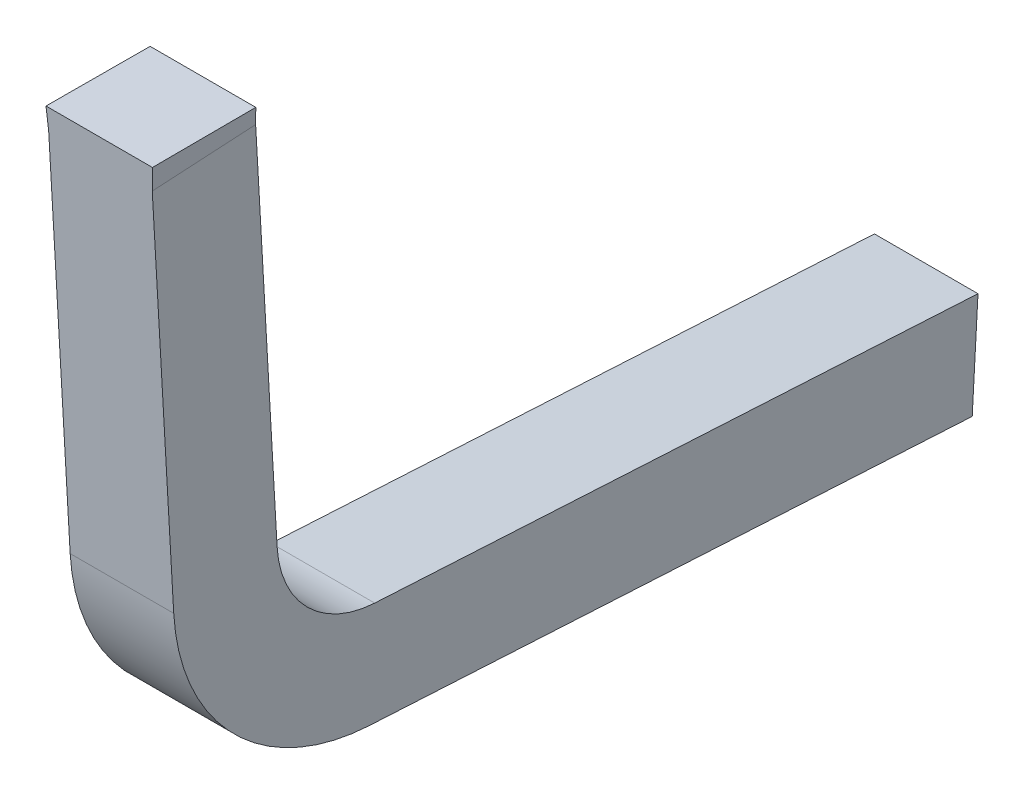
ISO-10303-21;
HEADER;
FILE_DESCRIPTION(('STEP AP214'),'2;1');
FILE_NAME('part.step','',(''),(''),'','','');
FILE_SCHEMA(('AUTOMOTIVE_DESIGN { 1 0 10303 214 1 1 1 1 }'));
ENDSEC;
DATA;
#1=APPLICATION_CONTEXT('core data for automotive mechanical design processes');
#2=APPLICATION_PROTOCOL_DEFINITION('international standard','automotive_design',2000,#1);
#3=PRODUCT_CONTEXT('',#1,'mechanical');
#4=PRODUCT('Part','Part','',(#3));
#5=PRODUCT_RELATED_PRODUCT_CATEGORY('part','',(#4));
#6=PRODUCT_DEFINITION_FORMATION('','',#4);
#7=PRODUCT_DEFINITION_CONTEXT('part definition',#1,'design');
#8=PRODUCT_DEFINITION('design','',#6,#7);
#9=PRODUCT_DEFINITION_SHAPE('','',#8);
#10=(LENGTH_UNIT() NAMED_UNIT(*) SI_UNIT(.MILLI.,.METRE.));
#11=(NAMED_UNIT(*) PLANE_ANGLE_UNIT() SI_UNIT($,.RADIAN.));
#12=(NAMED_UNIT(*) SI_UNIT($,.STERADIAN.) SOLID_ANGLE_UNIT());
#13=UNCERTAINTY_MEASURE_WITH_UNIT(LENGTH_MEASURE(1.E-05),#10,'distance_accuracy_value','');
#14=(GEOMETRIC_REPRESENTATION_CONTEXT(3) GLOBAL_UNCERTAINTY_ASSIGNED_CONTEXT((#13)) GLOBAL_UNIT_ASSIGNED_CONTEXT((#10,
#11,#12)) REPRESENTATION_CONTEXT('',''));
#15=CARTESIAN_POINT('',(0.,0.,0.));
#16=DIRECTION('',(0.,0.,1.));
#17=DIRECTION('',(1.,0.,0.));
#18=AXIS2_PLACEMENT_3D('',#15,#16,#17);
#19=CARTESIAN_POINT('',(4.398593165818,-2.29897527843,-10.34781984343));
#20=DIRECTION('',(0.997785157857701,0.0664110878974701,0.003787632922693));
#21=DIRECTION('',(-0.0664115642747469,0.997792315129046,0.));
#22=AXIS2_PLACEMENT_3D('',#19,#20,#21);
#23=PLANE('',#22);
#24=DIRECTION('',(0.,-0.0569406083110753,0.998377567418842));
#25=VECTOR('',#24,1.);
#26=CARTESIAN_POINT('',(4.4,-2.314349492935,-10.44885919008));
#27=LINE('',#26,#25);
#28=CARTESIAN_POINT('',(4.4,-2.31434949293492,-10.4488591900814));
#29=VERTEX_POINT('',#28);
#30=CARTESIAN_POINT('',(4.4,-2.32573761459728,-10.2491836765951));
#31=VERTEX_POINT('',#30);
#32=EDGE_CURVE('E98',#29,#31,#27,.T.);
#33=ORIENTED_EDGE('',*,*,#32,.T.);
#34=DIRECTION('',(0.0665190105147885,-0.996166318707982,-0.0568144938543089));
#35=VECTOR('',#34,1.);
#36=CARTESIAN_POINT('',(4.397186331635,-2.28360106392498,-10.2467804967704));
#37=LINE('',#36,#35);
#38=CARTESIAN_POINT('',(4.397186331635,-2.28360106392499,-10.2467804967704));
#39=VERTEX_POINT('',#38);
#40=EDGE_CURVE('E148',#39,#31,#37,.T.);
#41=ORIENTED_EDGE('',*,*,#40,.F.);
#42=DIRECTION('',(-0.0037960132015798,0.,0.999992795115932));
#43=VECTOR('',#42,1.);
#44=CARTESIAN_POINT('',(4.397946773511,-2.283601063925,-10.4471055106));
#45=LINE('',#44,#43);
#46=CARTESIAN_POINT('',(4.397946773511,-2.28360106392489,-10.4471055106019));
#47=VERTEX_POINT('',#46);
#48=EDGE_CURVE('E161',#47,#39,#45,.T.);
#49=ORIENTED_EDGE('',*,*,#48,.F.);
#50=DIRECTION('',(0.0665190105273533,-0.996166318707227,-0.0568144938528306));
#51=VECTOR('',#50,1.);
#52=CARTESIAN_POINT('',(4.397946773511,-2.28360106392483,-10.4471055106029));
#53=LINE('',#52,#51);
#54=EDGE_CURVE('E103',#47,#29,#53,.T.);
#55=ORIENTED_EDGE('',*,*,#54,.T.);
#56=EDGE_LOOP('',(#33,#41,#49,#55));
#57=FACE_BOUND('',#56,.T.);
#58=ADVANCED_FACE('F17',(#57),#23,.F.);
#59=CARTESIAN_POINT('',(4.5,-2.283601063925,-10.34694300368));
#60=DIRECTION('',(0.,1.,0.));
#61=DIRECTION('',(0.,0.,1.));
#62=AXIS2_PLACEMENT_3D('',#59,#60,#61);
#63=PLANE('',#62);
#64=DIRECTION('',(1.,0.,0.));
#65=VECTOR('',#64,1.);
#66=CARTESIAN_POINT('',(4.5,-2.28360106392498,-10.2467804967704));
#67=LINE('',#66,#65);
#68=CARTESIAN_POINT('',(4.60281366836525,-2.283601063925,-10.2467804967704));
#69=VERTEX_POINT('',#68);
#70=EDGE_CURVE('E154',#69,#39,#67,.F.);
#71=ORIENTED_EDGE('',*,*,#70,.F.);
#72=DIRECTION('',(0.00379601320426427,-1.7968426456006E-13,0.999992795115921));
#73=VECTOR('',#72,1.);
#74=CARTESIAN_POINT('',(4.6020532264892,-2.28360106392501,-10.4471055106));
#75=LINE('',#74,#73);
#76=CARTESIAN_POINT('',(4.60205322648913,-2.28360106392495,-10.447105510601));
#77=VERTEX_POINT('',#76);
#78=EDGE_CURVE('E119',#77,#69,#75,.T.);
#79=ORIENTED_EDGE('',*,*,#78,.F.);
#80=DIRECTION('',(1.,0.,0.));
#81=VECTOR('',#80,1.);
#82=CARTESIAN_POINT('',(4.5,-2.28360106392483,-10.4471055106029));
#83=LINE('',#82,#81);
#84=EDGE_CURVE('E125',#77,#47,#83,.F.);
#85=ORIENTED_EDGE('',*,*,#84,.T.);
#86=ORIENTED_EDGE('',*,*,#48,.T.);
#87=EDGE_LOOP('',(#71,#79,#85,#86));
#88=FACE_BOUND('',#87,.T.);
#89=ADVANCED_FACE('F243',(#88),#63,.T.);
#90=CARTESIAN_POINT('',(4.4,-2.909472777839,-11.05227927458));
#91=DIRECTION('',(1.,0.,0.));
#92=DIRECTION('',(0.,0.,-1.));
#93=AXIS2_PLACEMENT_3D('',#90,#91,#92);
#94=PLANE('',#93);
#95=CARTESIAN_POINT('',(4.4,-3.03,-10.69));
#96=DIRECTION('',(-1.,0.,0.));
#97=DIRECTION('',(0.,0.,1.));
#98=AXIS2_PLACEMENT_3D('',#95,#96,#97);
#99=CIRCLE('',#98,0.4);
#100=CARTESIAN_POINT('',(4.4,-3.05277624331319,-10.2906489730306));
#101=VERTEX_POINT('',#100);
#102=CARTESIAN_POINT('',(4.4,-3.42937693582933,-10.6676826720305));
#103=VERTEX_POINT('',#102);
#104=EDGE_CURVE('E142',#101,#103,#99,.F.);
#105=ORIENTED_EDGE('',*,*,#104,.F.);
#106=DIRECTION('',(0.,-0.998377567418718,-0.056940608313261));
#107=VECTOR('',#106,1.);
#108=CARTESIAN_POINT('',(4.4,-2.668188653621,-10.2687147349));
#109=LINE('',#108,#107);
#110=EDGE_CURVE('E145',#31,#101,#109,.T.);
#111=ORIENTED_EDGE('',*,*,#110,.F.);
#112=ORIENTED_EDGE('',*,*,#32,.F.);
#113=DIRECTION('',(0.,-0.998377567418801,-0.0569406083117901));
#114=VECTOR('',#113,1.);
#115=CARTESIAN_POINT('',(4.4,-2.662494592804,-10.46871499856));
#116=LINE('',#115,#114);
#117=CARTESIAN_POINT('',(4.4,-3.04138812167726,-10.4903244865168));
#118=VERTEX_POINT('',#117);
#119=EDGE_CURVE('E92',#29,#118,#116,.T.);
#120=ORIENTED_EDGE('',*,*,#119,.T.);
#121=CARTESIAN_POINT('',(4.4,-3.03,-10.69));
#122=DIRECTION('',(-1.,0.,0.));
#123=DIRECTION('',(0.,0.,1.));
#124=AXIS2_PLACEMENT_3D('',#121,#122,#123);
#125=CIRCLE('',#124,0.2);
#126=CARTESIAN_POINT('',(4.4,-3.22968846791482,-10.6788413360177));
#127=VERTEX_POINT('',#126);
#128=EDGE_CURVE('E20',#118,#127,#125,.F.);
#129=ORIENTED_EDGE('',*,*,#128,.T.);
#130=DIRECTION('',(0.,0.0557933199228295,0.998442339572991));
#131=VECTOR('',#130,1.);
#132=CARTESIAN_POINT('',(4.4,-3.262244863925,-11.26145022621));
#133=LINE('',#132,#131);
#134=CARTESIAN_POINT('',(4.4,-3.29480125993501,-11.8440591164004));
#135=VERTEX_POINT('',#134);
#136=EDGE_CURVE('E111',#135,#127,#133,.T.);
#137=ORIENTED_EDGE('',*,*,#136,.F.);
#138=DIRECTION('',(0.,-0.998442339574031,0.0557933199042218));
#139=VECTOR('',#138,1.);
#140=CARTESIAN_POINT('',(4.4,-3.394645493892,-11.83847978441));
#141=LINE('',#140,#139);
#142=CARTESIAN_POINT('',(4.4,-3.49448972784906,-11.8329004524196));
#143=VERTEX_POINT('',#142);
#144=EDGE_CURVE('E135',#135,#143,#141,.T.);
#145=ORIENTED_EDGE('',*,*,#144,.T.);
#146=DIRECTION('',(0.,0.055793319922371,0.998442339573017));
#147=VECTOR('',#146,1.);
#148=CARTESIAN_POINT('',(4.4,-3.461933331839,-11.25029156222));
#149=LINE('',#148,#147);
#150=EDGE_CURVE('E140',#143,#103,#149,.T.);
#151=ORIENTED_EDGE('',*,*,#150,.T.);
#152=EDGE_LOOP('',(#105,#111,#112,#120,#129,#137,#145,#151));
#153=FACE_BOUND('',#152,.T.);
#154=ADVANCED_FACE('F95',(#153),#94,.F.);
#155=CARTESIAN_POINT('',(4.5,-3.262244863925,-11.26145022621));
#156=DIRECTION('',(0.,0.998442339572991,-0.0557933199228295));
#157=DIRECTION('',(0.,0.0557933199228295,0.998442339572991));
#158=AXIS2_PLACEMENT_3D('',#155,#156,#157);
#159=PLANE('',#158);
#160=DIRECTION('',(0.,0.055793319922887,0.998442339572988));
#161=VECTOR('',#160,1.);
#162=CARTESIAN_POINT('',(4.6,-3.294801259935,-11.8440591164));
#163=LINE('',#162,#161);
#164=CARTESIAN_POINT('',(4.6,-3.29480125993501,-11.8440591164001));
#165=VERTEX_POINT('',#164);
#166=CARTESIAN_POINT('',(4.6,-3.2296884679148,-10.6788413360177));
#167=VERTEX_POINT('',#166);
#168=EDGE_CURVE('E129',#165,#167,#163,.T.);
#169=ORIENTED_EDGE('',*,*,#168,.F.);
#170=DIRECTION('',(1.,0.,0.));
#171=VECTOR('',#170,1.);
#172=CARTESIAN_POINT('',(4.5,-3.29480125993502,-11.8440591164004));
#173=LINE('',#172,#171);
#174=EDGE_CURVE('E126',#165,#135,#173,.F.);
#175=ORIENTED_EDGE('',*,*,#174,.T.);
#176=ORIENTED_EDGE('',*,*,#136,.T.);
#177=DIRECTION('',(-1.,0.,0.));
#178=VECTOR('',#177,1.);
#179=CARTESIAN_POINT('',(4.604,-3.22968846791485,-10.67884133602));
#180=LINE('',#179,#178);
#181=EDGE_CURVE('E110',#127,#167,#180,.F.);
#182=ORIENTED_EDGE('',*,*,#181,.T.);
#183=EDGE_LOOP('',(#169,#175,#176,#182));
#184=FACE_BOUND('',#183,.T.);
#185=ADVANCED_FACE('F234',(#184),#159,.T.);
#186=CARTESIAN_POINT('',(4.604,-3.03,-10.69));
#187=DIRECTION('',(-1.,0.,0.));
#188=DIRECTION('',(0.,0.,1.));
#189=AXIS2_PLACEMENT_3D('',#186,#187,#188);
#190=CYLINDRICAL_SURFACE('',#189,0.2);
#191=ORIENTED_EDGE('',*,*,#128,.F.);
#192=DIRECTION('',(1.,0.,0.));
#193=VECTOR('',#192,1.);
#194=CARTESIAN_POINT('',(4.5,-3.04138812169214,-10.4903244865176));
#195=LINE('',#194,#193);
#196=CARTESIAN_POINT('',(4.6,-3.04138812167779,-10.490324486518));
#197=VERTEX_POINT('',#196);
#198=EDGE_CURVE('E102',#118,#197,#195,.T.);
#199=ORIENTED_EDGE('',*,*,#198,.T.);
#200=CARTESIAN_POINT('',(4.6,-3.03,-10.69));
#201=DIRECTION('',(-1.,0.,0.));
#202=DIRECTION('',(0.,0.,1.));
#203=AXIS2_PLACEMENT_3D('',#200,#201,#202);
#204=CIRCLE('',#203,0.2);
#205=EDGE_CURVE('E185',#167,#197,#204,.T.);
#206=ORIENTED_EDGE('',*,*,#205,.F.);
#207=ORIENTED_EDGE('',*,*,#181,.F.);
#208=EDGE_LOOP('',(#191,#199,#206,#207));
#209=FACE_BOUND('',#208,.T.);
#210=ADVANCED_FACE('F107',(#209),#190,.F.);
#211=CARTESIAN_POINT('',(4.5,-2.662494592804,-10.46871499856));
#212=DIRECTION('',(0.,-0.0569406083117901,0.998377567418801));
#213=DIRECTION('',(0.,-0.998377567418801,-0.0569406083117901));
#214=AXIS2_PLACEMENT_3D('',#211,#212,#213);
#215=PLANE('',#214);
#216=DIRECTION('',(0.,0.998377567418456,0.0569406083178453));
#217=VECTOR('',#216,1.);
#218=CARTESIAN_POINT('',(4.6,-3.041388121692,-10.49032448652));
#219=LINE('',#218,#217);
#220=CARTESIAN_POINT('',(4.60000000000008,-2.314349492934,-10.44885919008));
#221=VERTEX_POINT('',#220);
#222=EDGE_CURVE('E114',#197,#221,#219,.T.);
#223=ORIENTED_EDGE('',*,*,#222,.F.);
#224=ORIENTED_EDGE('',*,*,#198,.F.);
#225=ORIENTED_EDGE('',*,*,#119,.F.);
#226=ORIENTED_EDGE('',*,*,#54,.F.);
#227=ORIENTED_EDGE('',*,*,#84,.F.);
#228=DIRECTION('',(0.0665190105284045,0.996166318705549,0.0568144938810225));
#229=VECTOR('',#228,1.);
#230=CARTESIAN_POINT('',(4.60000000000023,-2.31434949293401,-10.44885919008));
#231=LINE('',#230,#229);
#232=EDGE_CURVE('E116',#221,#77,#231,.T.);
#233=ORIENTED_EDGE('',*,*,#232,.F.);
#234=EDGE_LOOP('',(#223,#224,#225,#226,#227,#233));
#235=FACE_BOUND('',#234,.T.);
#236=ADVANCED_FACE('F112',(#235),#215,.F.);
#237=CARTESIAN_POINT('',(4.601406834183,-2.298975278429,-10.34781984343));
#238=DIRECTION('',(0.9977851578563,-0.06641108791847,-0.003787632923708));
#239=DIRECTION('',(0.0664115642957472,0.997792315127648,0.));
#240=AXIS2_PLACEMENT_3D('',#237,#238,#239);
#241=PLANE('',#240);
#242=ORIENTED_EDGE('',*,*,#232,.T.);
#243=ORIENTED_EDGE('',*,*,#78,.T.);
#244=DIRECTION('',(0.0665190105179218,0.996166318707772,0.0568144938543193));
#245=VECTOR('',#244,1.);
#246=CARTESIAN_POINT('',(4.6,-2.32573761459528,-10.249183676595));
#247=LINE('',#246,#245);
#248=CARTESIAN_POINT('',(4.6,-2.32573761459509,-10.2491836765983));
#249=VERTEX_POINT('',#248);
#250=EDGE_CURVE('E147',#249,#69,#247,.T.);
#251=ORIENTED_EDGE('',*,*,#250,.F.);
#252=DIRECTION('',(0.,-0.0569406083060912,0.998377567419126));
#253=VECTOR('',#252,1.);
#254=CARTESIAN_POINT('',(4.6,-2.314349492934,-10.44885919008));
#255=LINE('',#254,#253);
#256=EDGE_CURVE('E200',#221,#249,#255,.T.);
#257=ORIENTED_EDGE('',*,*,#256,.F.);
#258=EDGE_LOOP('',(#242,#243,#251,#257));
#259=FACE_BOUND('',#258,.T.);
#260=ADVANCED_FACE('F258',(#259),#241,.T.);
#261=CARTESIAN_POINT('',(4.5,-2.668188653621,-10.2687147349));
#262=DIRECTION('',(0.,-0.056940608313261,0.998377567418718));
#263=DIRECTION('',(0.,-0.998377567418718,-0.056940608313261));
#264=AXIS2_PLACEMENT_3D('',#261,#262,#263);
#265=PLANE('',#264);
#266=ORIENTED_EDGE('',*,*,#250,.T.);
#267=ORIENTED_EDGE('',*,*,#70,.T.);
#268=ORIENTED_EDGE('',*,*,#40,.T.);
#269=ORIENTED_EDGE('',*,*,#110,.T.);
#270=DIRECTION('',(-1.,0.,0.));
#271=VECTOR('',#270,1.);
#272=CARTESIAN_POINT('',(4.604,-3.05277624330094,-10.2906489730311));
#273=LINE('',#272,#271);
#274=CARTESIAN_POINT('',(4.6,-3.05277624331214,-10.2906489730312));
#275=VERTEX_POINT('',#274);
#276=EDGE_CURVE('E157',#275,#101,#273,.T.);
#277=ORIENTED_EDGE('',*,*,#276,.F.);
#278=DIRECTION('',(0.,-0.998377567419005,-0.0569406083082185));
#279=VECTOR('',#278,1.);
#280=CARTESIAN_POINT('',(4.6,-2.325737614595,-10.2491836766));
#281=LINE('',#280,#279);
#282=EDGE_CURVE('E184',#249,#275,#281,.T.);
#283=ORIENTED_EDGE('',*,*,#282,.F.);
#284=EDGE_LOOP('',(#266,#267,#268,#269,#277,#283));
#285=FACE_BOUND('',#284,.T.);
#286=ADVANCED_FACE('F227',(#285),#265,.T.);
#287=CARTESIAN_POINT('',(4.604,-3.03,-10.69));
#288=DIRECTION('',(-1.,0.,0.));
#289=DIRECTION('',(0.,0.,1.));
#290=AXIS2_PLACEMENT_3D('',#287,#288,#289);
#291=CYLINDRICAL_SURFACE('',#290,0.4);
#292=DIRECTION('',(1.,0.,0.));
#293=VECTOR('',#292,1.);
#294=CARTESIAN_POINT('',(4.5,-3.4293769358293,-10.66768267203));
#295=LINE('',#294,#293);
#296=CARTESIAN_POINT('',(4.6,-3.42937693582946,-10.6676826720306));
#297=VERTEX_POINT('',#296);
#298=EDGE_CURVE('E137',#103,#297,#295,.T.);
#299=ORIENTED_EDGE('',*,*,#298,.T.);
#300=CARTESIAN_POINT('',(4.6,-3.03,-10.69));
#301=DIRECTION('',(-1.,0.,0.));
#302=DIRECTION('',(0.,0.,1.));
#303=AXIS2_PLACEMENT_3D('',#300,#301,#302);
#304=CIRCLE('',#303,0.4);
#305=EDGE_CURVE('E181',#275,#297,#304,.F.);
#306=ORIENTED_EDGE('',*,*,#305,.F.);
#307=ORIENTED_EDGE('',*,*,#276,.T.);
#308=ORIENTED_EDGE('',*,*,#104,.T.);
#309=EDGE_LOOP('',(#299,#306,#307,#308));
#310=FACE_BOUND('',#309,.T.);
#311=ADVANCED_FACE('F220',(#310),#291,.T.);
#312=CARTESIAN_POINT('',(4.5,-3.461933331839,-11.25029156222));
#313=DIRECTION('',(0.,0.998442339573017,-0.055793319922371));
#314=DIRECTION('',(0.,0.055793319922371,0.998442339573017));
#315=AXIS2_PLACEMENT_3D('',#312,#313,#314);
#316=PLANE('',#315);
#317=ORIENTED_EDGE('',*,*,#298,.F.);
#318=ORIENTED_EDGE('',*,*,#150,.F.);
#319=DIRECTION('',(1.,0.,0.));
#320=VECTOR('',#319,1.);
#321=CARTESIAN_POINT('',(4.5,-3.49448972784898,-11.8329004524196));
#322=LINE('',#321,#320);
#323=CARTESIAN_POINT('',(4.6,-3.49448972784899,-11.8329004524199));
#324=VERTEX_POINT('',#323);
#325=EDGE_CURVE('E35',#143,#324,#322,.T.);
#326=ORIENTED_EDGE('',*,*,#325,.T.);
#327=DIRECTION('',(0.,-0.0557933199219327,-0.998442339573042));
#328=VECTOR('',#327,1.);
#329=CARTESIAN_POINT('',(4.6,-3.429376935829,-10.66768267202));
#330=LINE('',#329,#328);
#331=EDGE_CURVE('E26',#297,#324,#330,.T.);
#332=ORIENTED_EDGE('',*,*,#331,.F.);
#333=EDGE_LOOP('',(#317,#318,#326,#332));
#334=FACE_BOUND('',#333,.T.);
#335=ADVANCED_FACE('F222',(#334),#316,.F.);
#336=CARTESIAN_POINT('',(4.5,-3.394645493892,-11.83847978441));
#337=DIRECTION('',(0.,0.0557933199042218,0.998442339574031));
#338=DIRECTION('',(0.,-0.998442339574031,0.0557933199042218));
#339=AXIS2_PLACEMENT_3D('',#336,#337,#338);
#340=PLANE('',#339);
#341=DIRECTION('',(0.,0.998442339574254,-0.0557933199002383));
#342=VECTOR('',#341,1.);
#343=CARTESIAN_POINT('',(4.6,-3.494489727849,-11.83290045242));
#344=LINE('',#343,#342);
#345=EDGE_CURVE('E11',#324,#165,#344,.T.);
#346=ORIENTED_EDGE('',*,*,#345,.F.);
#347=ORIENTED_EDGE('',*,*,#325,.F.);
#348=ORIENTED_EDGE('',*,*,#144,.F.);
#349=ORIENTED_EDGE('',*,*,#174,.F.);
#350=EDGE_LOOP('',(#346,#347,#348,#349));
#351=FACE_BOUND('',#350,.T.);
#352=ADVANCED_FACE('F230',(#351),#340,.F.);
#353=CARTESIAN_POINT('',(4.6,-2.909472777838,-11.05227927458));
#354=DIRECTION('',(1.,0.,0.));
#355=DIRECTION('',(0.,0.,-1.));
#356=AXIS2_PLACEMENT_3D('',#353,#354,#355);
#357=PLANE('',#356);
#358=ORIENTED_EDGE('',*,*,#331,.T.);
#359=ORIENTED_EDGE('',*,*,#345,.T.);
#360=ORIENTED_EDGE('',*,*,#168,.T.);
#361=ORIENTED_EDGE('',*,*,#205,.T.);
#362=ORIENTED_EDGE('',*,*,#222,.T.);
#363=ORIENTED_EDGE('',*,*,#256,.T.);
#364=ORIENTED_EDGE('',*,*,#282,.T.);
#365=ORIENTED_EDGE('',*,*,#305,.T.);
#366=EDGE_LOOP('',(#358,#359,#360,#361,#362,#363,#364,#365));
#367=FACE_BOUND('',#366,.T.);
#368=ADVANCED_FACE('F224',(#367),#357,.T.);
#369=CLOSED_SHELL('',(#58,#89,#154,#185,#210,#236,#260,#286,#311,#335,#352,#368));
#370=MANIFOLD_SOLID_BREP('B1',#369);
#371=ADVANCED_BREP_SHAPE_REPRESENTATION('',(#18,#370),#14);
#372=SHAPE_DEFINITION_REPRESENTATION(#9,#371);
ENDSEC;
END-ISO-10303-21;
